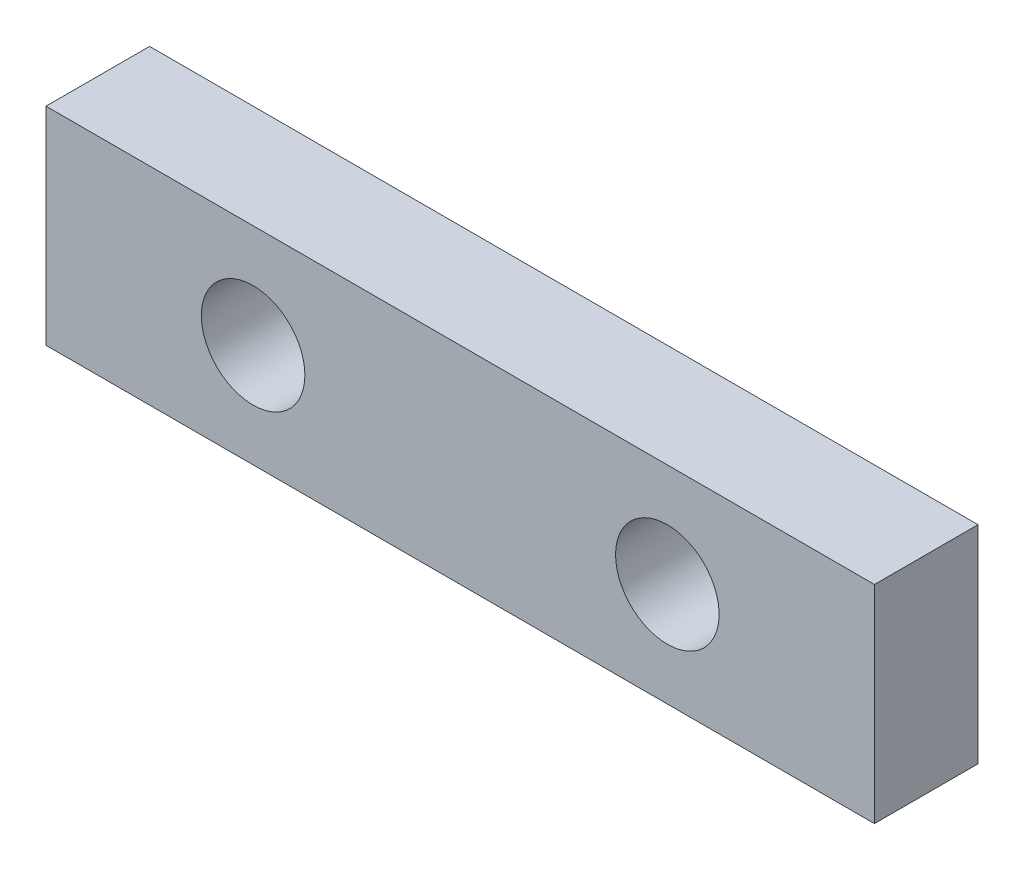
ISO-10303-21;
HEADER;
FILE_DESCRIPTION(('STEP AP214'),'2;1');
FILE_NAME('part.step','',(''),(''),'','','');
FILE_SCHEMA(('AUTOMOTIVE_DESIGN { 1 0 10303 214 1 1 1 1 }'));
ENDSEC;
DATA;
#1=APPLICATION_CONTEXT('core data for automotive mechanical design processes');
#2=APPLICATION_PROTOCOL_DEFINITION('international standard','automotive_design',2000,#1);
#3=PRODUCT_CONTEXT('',#1,'mechanical');
#4=PRODUCT('Part','Part','',(#3));
#5=PRODUCT_RELATED_PRODUCT_CATEGORY('part','',(#4));
#6=PRODUCT_DEFINITION_FORMATION('','',#4);
#7=PRODUCT_DEFINITION_CONTEXT('part definition',#1,'design');
#8=PRODUCT_DEFINITION('design','',#6,#7);
#9=PRODUCT_DEFINITION_SHAPE('','',#8);
#10=(LENGTH_UNIT() NAMED_UNIT(*) SI_UNIT(.MILLI.,.METRE.));
#11=(NAMED_UNIT(*) PLANE_ANGLE_UNIT() SI_UNIT($,.RADIAN.));
#12=(NAMED_UNIT(*) SI_UNIT($,.STERADIAN.) SOLID_ANGLE_UNIT());
#13=UNCERTAINTY_MEASURE_WITH_UNIT(LENGTH_MEASURE(1.E-05),#10,'distance_accuracy_value','');
#14=(GEOMETRIC_REPRESENTATION_CONTEXT(3) GLOBAL_UNCERTAINTY_ASSIGNED_CONTEXT((#13)) GLOBAL_UNIT_ASSIGNED_CONTEXT((#10,
#11,#12)) REPRESENTATION_CONTEXT('',''));
#15=CARTESIAN_POINT('',(0.,0.,0.));
#16=DIRECTION('',(0.,0.,1.));
#17=DIRECTION('',(1.,0.,0.));
#18=AXIS2_PLACEMENT_3D('',#15,#16,#17);
#19=CARTESIAN_POINT('',(0.,0.,5.));
#20=DIRECTION('',(0.,0.,1.));
#21=DIRECTION('',(1.,0.,0.));
#22=AXIS2_PLACEMENT_3D('',#19,#20,#21);
#23=PLANE('',#22);
#24=CARTESIAN_POINT('',(-10.,0.,5.));
#25=DIRECTION('',(0.,0.,1.));
#26=DIRECTION('',(1.,0.,0.));
#27=AXIS2_PLACEMENT_3D('',#24,#25,#26);
#28=CIRCLE('',#27,2.5);
#29=CARTESIAN_POINT('',(-7.5,0.,5.));
#30=VERTEX_POINT('',#29);
#31=EDGE_CURVE('E100',#30,#30,#28,.T.);
#32=ORIENTED_EDGE('',*,*,#31,.F.);
#33=EDGE_LOOP('',(#32));
#34=FACE_BOUND('',#33,.T.);
#35=DIRECTION('',(0.,1.,0.));
#36=VECTOR('',#35,1.);
#37=CARTESIAN_POINT('',(20.,5.,5.));
#38=LINE('',#37,#36);
#39=CARTESIAN_POINT('',(20.,-5.,5.));
#40=VERTEX_POINT('',#39);
#41=CARTESIAN_POINT('',(20.,5.,5.));
#42=VERTEX_POINT('',#41);
#43=EDGE_CURVE('E85',#40,#42,#38,.T.);
#44=ORIENTED_EDGE('',*,*,#43,.T.);
#45=DIRECTION('',(-1.,0.,0.));
#46=VECTOR('',#45,1.);
#47=CARTESIAN_POINT('',(-20.,5.,5.));
#48=LINE('',#47,#46);
#49=CARTESIAN_POINT('',(-20.,5.,5.));
#50=VERTEX_POINT('',#49);
#51=EDGE_CURVE('E80',#42,#50,#48,.T.);
#52=ORIENTED_EDGE('',*,*,#51,.T.);
#53=DIRECTION('',(0.,-1.,0.));
#54=VECTOR('',#53,1.);
#55=CARTESIAN_POINT('',(-20.,5.,5.));
#56=LINE('',#55,#54);
#57=CARTESIAN_POINT('',(-20.,-5.,5.));
#58=VERTEX_POINT('',#57);
#59=EDGE_CURVE('E83',#50,#58,#56,.T.);
#60=ORIENTED_EDGE('',*,*,#59,.T.);
#61=DIRECTION('',(1.,0.,0.));
#62=VECTOR('',#61,1.);
#63=CARTESIAN_POINT('',(-20.,-5.,5.));
#64=LINE('',#63,#62);
#65=EDGE_CURVE('E50',#58,#40,#64,.T.);
#66=ORIENTED_EDGE('',*,*,#65,.T.);
#67=EDGE_LOOP('',(#44,#52,#60,#66));
#68=FACE_BOUND('',#67,.T.);
#69=CARTESIAN_POINT('',(10.,0.,5.));
#70=DIRECTION('',(0.,0.,1.));
#71=DIRECTION('',(-1.,0.,0.));
#72=AXIS2_PLACEMENT_3D('',#69,#70,#71);
#73=CIRCLE('',#72,2.5);
#74=CARTESIAN_POINT('',(7.5,0.,5.));
#75=VERTEX_POINT('',#74);
#76=EDGE_CURVE('E115',#75,#75,#73,.T.);
#77=ORIENTED_EDGE('',*,*,#76,.F.);
#78=EDGE_LOOP('',(#77));
#79=FACE_BOUND('',#78,.T.);
#80=ADVANCED_FACE('F33',(#34,#68,#79),#23,.T.);
#81=CARTESIAN_POINT('',(0.,0.,0.));
#82=DIRECTION('',(0.,0.,1.));
#83=DIRECTION('',(1.,0.,0.));
#84=AXIS2_PLACEMENT_3D('',#81,#82,#83);
#85=PLANE('',#84);
#86=DIRECTION('',(0.,1.,0.));
#87=VECTOR('',#86,1.);
#88=CARTESIAN_POINT('',(20.,5.,0.));
#89=LINE('',#88,#87);
#90=CARTESIAN_POINT('',(20.,-5.,0.));
#91=VERTEX_POINT('',#90);
#92=CARTESIAN_POINT('',(20.,5.,0.));
#93=VERTEX_POINT('',#92);
#94=EDGE_CURVE('E97',#91,#93,#89,.T.);
#95=ORIENTED_EDGE('',*,*,#94,.F.);
#96=DIRECTION('',(1.,0.,0.));
#97=VECTOR('',#96,1.);
#98=CARTESIAN_POINT('',(-20.,-5.,0.));
#99=LINE('',#98,#97);
#100=CARTESIAN_POINT('',(-20.,-5.,0.));
#101=VERTEX_POINT('',#100);
#102=EDGE_CURVE('E73',#101,#91,#99,.T.);
#103=ORIENTED_EDGE('',*,*,#102,.F.);
#104=DIRECTION('',(0.,-1.,0.));
#105=VECTOR('',#104,1.);
#106=CARTESIAN_POINT('',(-20.,5.,0.));
#107=LINE('',#106,#105);
#108=CARTESIAN_POINT('',(-20.,5.,0.));
#109=VERTEX_POINT('',#108);
#110=EDGE_CURVE('E67',#109,#101,#107,.T.);
#111=ORIENTED_EDGE('',*,*,#110,.F.);
#112=DIRECTION('',(-1.,0.,0.));
#113=VECTOR('',#112,1.);
#114=CARTESIAN_POINT('',(-20.,5.,0.));
#115=LINE('',#114,#113);
#116=EDGE_CURVE('E89',#93,#109,#115,.T.);
#117=ORIENTED_EDGE('',*,*,#116,.F.);
#118=EDGE_LOOP('',(#95,#103,#111,#117));
#119=FACE_BOUND('',#118,.T.);
#120=CARTESIAN_POINT('',(-10.,0.,0.));
#121=DIRECTION('',(0.,0.,1.));
#122=DIRECTION('',(1.,0.,0.));
#123=AXIS2_PLACEMENT_3D('',#120,#121,#122);
#124=CIRCLE('',#123,2.5);
#125=CARTESIAN_POINT('',(-7.5,0.,0.));
#126=VERTEX_POINT('',#125);
#127=EDGE_CURVE('E112',#126,#126,#124,.T.);
#128=ORIENTED_EDGE('',*,*,#127,.T.);
#129=EDGE_LOOP('',(#128));
#130=FACE_BOUND('',#129,.T.);
#131=CARTESIAN_POINT('',(10.,0.,0.));
#132=DIRECTION('',(0.,0.,1.));
#133=DIRECTION('',(-1.,0.,0.));
#134=AXIS2_PLACEMENT_3D('',#131,#132,#133);
#135=CIRCLE('',#134,2.5);
#136=CARTESIAN_POINT('',(7.5,0.,0.));
#137=VERTEX_POINT('',#136);
#138=EDGE_CURVE('E118',#137,#137,#135,.T.);
#139=ORIENTED_EDGE('',*,*,#138,.T.);
#140=EDGE_LOOP('',(#139));
#141=FACE_BOUND('',#140,.T.);
#142=ADVANCED_FACE('F108',(#119,#130,#141),#85,.F.);
#143=CARTESIAN_POINT('',(20.,5.,5.));
#144=DIRECTION('',(-1.,0.,0.));
#145=DIRECTION('',(0.,0.,1.));
#146=AXIS2_PLACEMENT_3D('',#143,#144,#145);
#147=PLANE('',#146);
#148=ORIENTED_EDGE('',*,*,#94,.T.);
#149=DIRECTION('',(0.,0.,-1.));
#150=VECTOR('',#149,1.);
#151=CARTESIAN_POINT('',(20.,5.,5.));
#152=LINE('',#151,#150);
#153=EDGE_CURVE('E11',#42,#93,#152,.T.);
#154=ORIENTED_EDGE('',*,*,#153,.F.);
#155=ORIENTED_EDGE('',*,*,#43,.F.);
#156=DIRECTION('',(0.,0.,-1.));
#157=VECTOR('',#156,1.);
#158=CARTESIAN_POINT('',(20.,-5.,5.));
#159=LINE('',#158,#157);
#160=EDGE_CURVE('E93',#40,#91,#159,.T.);
#161=ORIENTED_EDGE('',*,*,#160,.T.);
#162=EDGE_LOOP('',(#148,#154,#155,#161));
#163=FACE_BOUND('',#162,.T.);
#164=ADVANCED_FACE('F35',(#163),#147,.F.);
#165=CARTESIAN_POINT('',(-20.,5.,5.));
#166=DIRECTION('',(0.,-1.,0.));
#167=DIRECTION('',(1.,0.,0.));
#168=AXIS2_PLACEMENT_3D('',#165,#166,#167);
#169=PLANE('',#168);
#170=ORIENTED_EDGE('',*,*,#116,.T.);
#171=DIRECTION('',(0.,0.,-1.));
#172=VECTOR('',#171,1.);
#173=CARTESIAN_POINT('',(-20.,5.,5.));
#174=LINE('',#173,#172);
#175=EDGE_CURVE('E42',#50,#109,#174,.T.);
#176=ORIENTED_EDGE('',*,*,#175,.F.);
#177=ORIENTED_EDGE('',*,*,#51,.F.);
#178=ORIENTED_EDGE('',*,*,#153,.T.);
#179=EDGE_LOOP('',(#170,#176,#177,#178));
#180=FACE_BOUND('',#179,.T.);
#181=ADVANCED_FACE('F88',(#180),#169,.F.);
#182=CARTESIAN_POINT('',(-20.,5.,5.));
#183=DIRECTION('',(1.,0.,0.));
#184=DIRECTION('',(0.,0.,-1.));
#185=AXIS2_PLACEMENT_3D('',#182,#183,#184);
#186=PLANE('',#185);
#187=ORIENTED_EDGE('',*,*,#110,.T.);
#188=DIRECTION('',(0.,0.,-1.));
#189=VECTOR('',#188,1.);
#190=CARTESIAN_POINT('',(-20.,-5.,5.));
#191=LINE('',#190,#189);
#192=EDGE_CURVE('E90',#58,#101,#191,.T.);
#193=ORIENTED_EDGE('',*,*,#192,.F.);
#194=ORIENTED_EDGE('',*,*,#59,.F.);
#195=ORIENTED_EDGE('',*,*,#175,.T.);
#196=EDGE_LOOP('',(#187,#193,#194,#195));
#197=FACE_BOUND('',#196,.T.);
#198=ADVANCED_FACE('F91',(#197),#186,.F.);
#199=CARTESIAN_POINT('',(-20.,-5.,5.));
#200=DIRECTION('',(0.,1.,0.));
#201=DIRECTION('',(0.,0.,1.));
#202=AXIS2_PLACEMENT_3D('',#199,#200,#201);
#203=PLANE('',#202);
#204=ORIENTED_EDGE('',*,*,#102,.T.);
#205=ORIENTED_EDGE('',*,*,#160,.F.);
#206=ORIENTED_EDGE('',*,*,#65,.F.);
#207=ORIENTED_EDGE('',*,*,#192,.T.);
#208=EDGE_LOOP('',(#204,#205,#206,#207));
#209=FACE_BOUND('',#208,.T.);
#210=ADVANCED_FACE('F105',(#209),#203,.F.);
#211=CARTESIAN_POINT('',(-10.,0.,5.));
#212=DIRECTION('',(0.,0.,-1.));
#213=DIRECTION('',(-1.,0.,0.));
#214=AXIS2_PLACEMENT_3D('',#211,#212,#213);
#215=CYLINDRICAL_SURFACE('',#214,2.5);
#216=ORIENTED_EDGE('',*,*,#31,.T.);
#217=EDGE_LOOP('',(#216));
#218=FACE_BOUND('',#217,.T.);
#219=ORIENTED_EDGE('',*,*,#127,.F.);
#220=EDGE_LOOP('',(#219));
#221=FACE_BOUND('',#220,.T.);
#222=ADVANCED_FACE('F135',(#218,#221),#215,.F.);
#223=CARTESIAN_POINT('',(10.,0.,5.));
#224=DIRECTION('',(0.,0.,-1.));
#225=DIRECTION('',(-1.,0.,0.));
#226=AXIS2_PLACEMENT_3D('',#223,#224,#225);
#227=CYLINDRICAL_SURFACE('',#226,2.5);
#228=ORIENTED_EDGE('',*,*,#76,.T.);
#229=EDGE_LOOP('',(#228));
#230=FACE_BOUND('',#229,.T.);
#231=ORIENTED_EDGE('',*,*,#138,.F.);
#232=EDGE_LOOP('',(#231));
#233=FACE_BOUND('',#232,.T.);
#234=ADVANCED_FACE('F124',(#230,#233),#227,.F.);
#235=CLOSED_SHELL('',(#80,#142,#164,#181,#198,#210,#222,#234));
#236=MANIFOLD_SOLID_BREP('B2',#235);
#237=ADVANCED_BREP_SHAPE_REPRESENTATION('',(#18,#236),#14);
#238=SHAPE_DEFINITION_REPRESENTATION(#9,#237);
ENDSEC;
END-ISO-10303-21;
